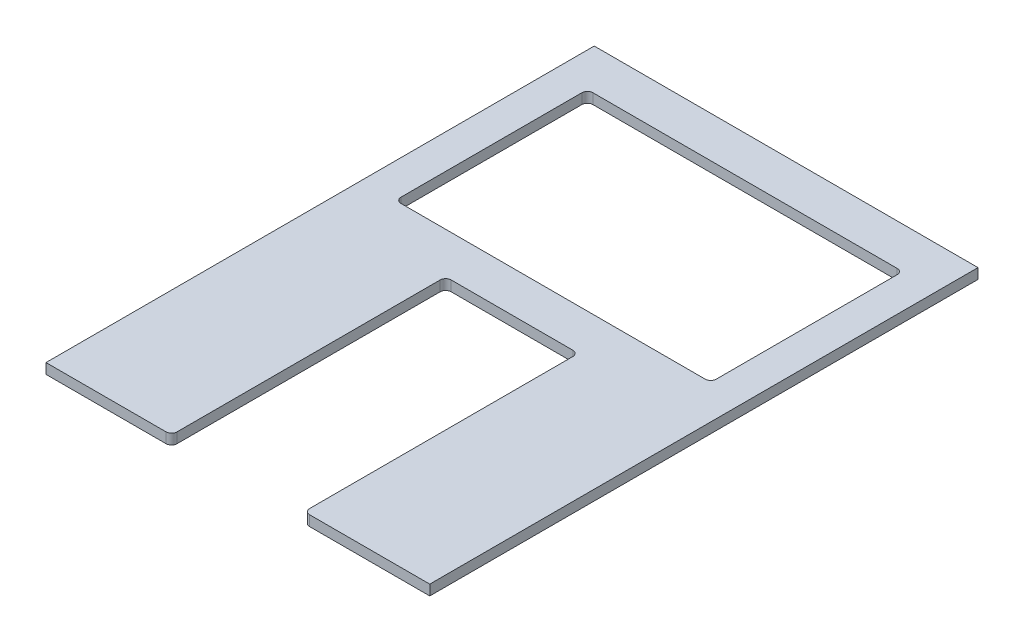
ISO-10303-21;
HEADER;
FILE_DESCRIPTION(('STEP AP214'),'2;1');
FILE_NAME('part.step','',(''),(''),'','','');
FILE_SCHEMA(('AUTOMOTIVE_DESIGN { 1 0 10303 214 1 1 1 1 }'));
ENDSEC;
DATA;
#1=APPLICATION_CONTEXT('core data for automotive mechanical design processes');
#2=APPLICATION_PROTOCOL_DEFINITION('international standard','automotive_design',2000,#1);
#3=PRODUCT_CONTEXT('',#1,'mechanical');
#4=PRODUCT('Part','Part','',(#3));
#5=PRODUCT_RELATED_PRODUCT_CATEGORY('part','',(#4));
#6=PRODUCT_DEFINITION_FORMATION('','',#4);
#7=PRODUCT_DEFINITION_CONTEXT('part definition',#1,'design');
#8=PRODUCT_DEFINITION('design','',#6,#7);
#9=PRODUCT_DEFINITION_SHAPE('','',#8);
#10=(LENGTH_UNIT() NAMED_UNIT(*) SI_UNIT(.MILLI.,.METRE.));
#11=(NAMED_UNIT(*) PLANE_ANGLE_UNIT() SI_UNIT($,.RADIAN.));
#12=(NAMED_UNIT(*) SI_UNIT($,.STERADIAN.) SOLID_ANGLE_UNIT());
#13=UNCERTAINTY_MEASURE_WITH_UNIT(LENGTH_MEASURE(1.E-05),#10,'distance_accuracy_value','');
#14=(GEOMETRIC_REPRESENTATION_CONTEXT(3) GLOBAL_UNCERTAINTY_ASSIGNED_CONTEXT((#13)) GLOBAL_UNIT_ASSIGNED_CONTEXT((#10,
#11,#12)) REPRESENTATION_CONTEXT('',''));
#15=CARTESIAN_POINT('',(0.,0.,0.));
#16=DIRECTION('',(0.,0.,1.));
#17=DIRECTION('',(1.,0.,0.));
#18=AXIS2_PLACEMENT_3D('',#15,#16,#17);
#19=CARTESIAN_POINT('',(-88.9,4.7625,127.));
#20=DIRECTION('',(0.,1.,0.));
#21=DIRECTION('',(0.,0.,1.));
#22=AXIS2_PLACEMENT_3D('',#19,#20,#21);
#23=PLANE('',#22);
#24=DIRECTION('',(0.,0.,1.));
#25=VECTOR('',#24,1.);
#26=CARTESIAN_POINT('',(30.734,4.7625,0.));
#27=LINE('',#26,#25);
#28=CARTESIAN_POINT('',(30.734,4.7625,2.53999999999994));
#29=VERTEX_POINT('',#28);
#30=CARTESIAN_POINT('',(30.734,4.7625,124.46));
#31=VERTEX_POINT('',#30);
#32=EDGE_CURVE('E186',#29,#31,#27,.T.);
#33=ORIENTED_EDGE('',*,*,#32,.T.);
#34=CARTESIAN_POINT('',(33.274,4.7625,124.46));
#35=DIRECTION('',(0.,1.,0.));
#36=DIRECTION('',(0.,0.,1.));
#37=AXIS2_PLACEMENT_3D('',#34,#35,#36);
#38=CIRCLE('',#37,2.54);
#39=CARTESIAN_POINT('',(33.274,4.7625,127.));
#40=VERTEX_POINT('',#39);
#41=EDGE_CURVE('E182',#31,#40,#38,.T.);
#42=ORIENTED_EDGE('',*,*,#41,.T.);
#43=DIRECTION('',(1.,0.,0.));
#44=VECTOR('',#43,1.);
#45=CARTESIAN_POINT('',(88.9,4.7625,127.));
#46=LINE('',#45,#44);
#47=CARTESIAN_POINT('',(88.9,4.7625,127.));
#48=VERTEX_POINT('',#47);
#49=EDGE_CURVE('E175',#40,#48,#46,.T.);
#50=ORIENTED_EDGE('',*,*,#49,.T.);
#51=DIRECTION('',(0.,0.,-1.));
#52=VECTOR('',#51,1.);
#53=CARTESIAN_POINT('',(88.9,4.7625,-127.));
#54=LINE('',#53,#52);
#55=CARTESIAN_POINT('',(88.9,4.7625,-127.));
#56=VERTEX_POINT('',#55);
#57=EDGE_CURVE('E179',#48,#56,#54,.T.);
#58=ORIENTED_EDGE('',*,*,#57,.T.);
#59=DIRECTION('',(-1.,0.,0.));
#60=VECTOR('',#59,1.);
#61=CARTESIAN_POINT('',(88.9,4.7625,-127.));
#62=LINE('',#61,#60);
#63=CARTESIAN_POINT('',(-88.9,4.7625,-127.));
#64=VERTEX_POINT('',#63);
#65=EDGE_CURVE('E201',#56,#64,#62,.T.);
#66=ORIENTED_EDGE('',*,*,#65,.T.);
#67=DIRECTION('',(0.,0.,1.));
#68=VECTOR('',#67,1.);
#69=CARTESIAN_POINT('',(-88.9,4.7625,-127.));
#70=LINE('',#69,#68);
#71=CARTESIAN_POINT('',(-88.9,4.7625,127.));
#72=VERTEX_POINT('',#71);
#73=EDGE_CURVE('E203',#64,#72,#70,.T.);
#74=ORIENTED_EDGE('',*,*,#73,.T.);
#75=DIRECTION('',(1.,0.,0.));
#76=VECTOR('',#75,1.);
#77=CARTESIAN_POINT('',(-30.734,4.7625,127.));
#78=LINE('',#77,#76);
#79=CARTESIAN_POINT('',(-33.274,4.7625,127.));
#80=VERTEX_POINT('',#79);
#81=EDGE_CURVE('E229',#72,#80,#78,.T.);
#82=ORIENTED_EDGE('',*,*,#81,.T.);
#83=CARTESIAN_POINT('',(-33.274,4.7625,124.46));
#84=DIRECTION('',(0.,1.,0.));
#85=DIRECTION('',(0.,0.,1.));
#86=AXIS2_PLACEMENT_3D('',#83,#84,#85);
#87=CIRCLE('',#86,2.54);
#88=CARTESIAN_POINT('',(-30.734,4.7625,124.46));
#89=VERTEX_POINT('',#88);
#90=EDGE_CURVE('E246',#80,#89,#87,.T.);
#91=ORIENTED_EDGE('',*,*,#90,.T.);
#92=DIRECTION('',(0.,0.,-1.));
#93=VECTOR('',#92,1.);
#94=CARTESIAN_POINT('',(-30.734,4.7625,127.));
#95=LINE('',#94,#93);
#96=CARTESIAN_POINT('',(-30.734,4.7625,2.53999999999994));
#97=VERTEX_POINT('',#96);
#98=EDGE_CURVE('E337',#89,#97,#95,.T.);
#99=ORIENTED_EDGE('',*,*,#98,.T.);
#100=CARTESIAN_POINT('',(-28.194,4.7625,2.53999999999994));
#101=DIRECTION('',(0.,1.,0.));
#102=DIRECTION('',(0.,0.,1.));
#103=AXIS2_PLACEMENT_3D('',#100,#101,#102);
#104=CIRCLE('',#103,2.54);
#105=CARTESIAN_POINT('',(-28.194,4.7625,0.));
#106=VERTEX_POINT('',#105);
#107=EDGE_CURVE('E282',#97,#106,#104,.F.);
#108=ORIENTED_EDGE('',*,*,#107,.T.);
#109=DIRECTION('',(1.,0.,0.));
#110=VECTOR('',#109,1.);
#111=CARTESIAN_POINT('',(-30.734,4.7625,0.));
#112=LINE('',#111,#110);
#113=CARTESIAN_POINT('',(28.194,4.7625,0.));
#114=VERTEX_POINT('',#113);
#115=EDGE_CURVE('E340',#106,#114,#112,.T.);
#116=ORIENTED_EDGE('',*,*,#115,.T.);
#117=CARTESIAN_POINT('',(28.194,4.7625,2.53999999999994));
#118=DIRECTION('',(0.,1.,0.));
#119=DIRECTION('',(0.,0.,1.));
#120=AXIS2_PLACEMENT_3D('',#117,#118,#119);
#121=CIRCLE('',#120,2.54);
#122=EDGE_CURVE('E286',#114,#29,#121,.F.);
#123=ORIENTED_EDGE('',*,*,#122,.T.);
#124=EDGE_LOOP('',(#33,#42,#50,#58,#66,#74,#82,#91,#99,#108,#116,#123));
#125=FACE_BOUND('',#124,.T.);
#126=DIRECTION('',(1.,0.,0.));
#127=VECTOR('',#126,1.);
#128=CARTESIAN_POINT('',(73.025,4.7625,-19.05));
#129=LINE('',#128,#127);
#130=CARTESIAN_POINT('',(-70.485,4.7625,-19.05));
#131=VERTEX_POINT('',#130);
#132=CARTESIAN_POINT('',(70.485,4.7625,-19.05));
#133=VERTEX_POINT('',#132);
#134=EDGE_CURVE('E325',#131,#133,#129,.T.);
#135=ORIENTED_EDGE('',*,*,#134,.F.);
#136=CARTESIAN_POINT('',(-70.485,4.7625,-21.59));
#137=DIRECTION('',(0.,1.,0.));
#138=DIRECTION('',(0.,0.,1.));
#139=AXIS2_PLACEMENT_3D('',#136,#137,#138);
#140=CIRCLE('',#139,2.54);
#141=CARTESIAN_POINT('',(-73.025,4.7625,-21.59));
#142=VERTEX_POINT('',#141);
#143=EDGE_CURVE('E290',#131,#142,#140,.F.);
#144=ORIENTED_EDGE('',*,*,#143,.T.);
#145=DIRECTION('',(0.,0.,1.));
#146=VECTOR('',#145,1.);
#147=CARTESIAN_POINT('',(-73.025,4.7625,-107.95));
#148=LINE('',#147,#146);
#149=CARTESIAN_POINT('',(-73.025,4.7625,-105.41));
#150=VERTEX_POINT('',#149);
#151=EDGE_CURVE('E319',#150,#142,#148,.T.);
#152=ORIENTED_EDGE('',*,*,#151,.F.);
#153=CARTESIAN_POINT('',(-70.485,4.7625,-105.41));
#154=DIRECTION('',(0.,1.,0.));
#155=DIRECTION('',(0.,0.,1.));
#156=AXIS2_PLACEMENT_3D('',#153,#154,#155);
#157=CIRCLE('',#156,2.54);
#158=CARTESIAN_POINT('',(-70.485,4.7625,-107.95));
#159=VERTEX_POINT('',#158);
#160=EDGE_CURVE('E11',#150,#159,#157,.F.);
#161=ORIENTED_EDGE('',*,*,#160,.T.);
#162=DIRECTION('',(-1.,0.,0.));
#163=VECTOR('',#162,1.);
#164=CARTESIAN_POINT('',(73.025,4.7625,-107.95));
#165=LINE('',#164,#163);
#166=CARTESIAN_POINT('',(70.485,4.7625,-107.95));
#167=VERTEX_POINT('',#166);
#168=EDGE_CURVE('E213',#167,#159,#165,.T.);
#169=ORIENTED_EDGE('',*,*,#168,.F.);
#170=CARTESIAN_POINT('',(70.485,4.7625,-105.41));
#171=DIRECTION('',(0.,1.,0.));
#172=DIRECTION('',(0.,0.,1.));
#173=AXIS2_PLACEMENT_3D('',#170,#171,#172);
#174=CIRCLE('',#173,2.54);
#175=CARTESIAN_POINT('',(73.025,4.7625,-105.41));
#176=VERTEX_POINT('',#175);
#177=EDGE_CURVE('E53',#167,#176,#174,.F.);
#178=ORIENTED_EDGE('',*,*,#177,.T.);
#179=DIRECTION('',(0.,0.,-1.));
#180=VECTOR('',#179,1.);
#181=CARTESIAN_POINT('',(73.025,4.7625,-107.95));
#182=LINE('',#181,#180);
#183=CARTESIAN_POINT('',(73.025,4.7625,-21.59));
#184=VERTEX_POINT('',#183);
#185=EDGE_CURVE('E323',#184,#176,#182,.T.);
#186=ORIENTED_EDGE('',*,*,#185,.F.);
#187=CARTESIAN_POINT('',(70.485,4.7625,-21.59));
#188=DIRECTION('',(0.,1.,0.));
#189=DIRECTION('',(0.,0.,1.));
#190=AXIS2_PLACEMENT_3D('',#187,#188,#189);
#191=CIRCLE('',#190,2.54);
#192=EDGE_CURVE('E294',#184,#133,#191,.F.);
#193=ORIENTED_EDGE('',*,*,#192,.T.);
#194=EDGE_LOOP('',(#135,#144,#152,#161,#169,#178,#186,#193));
#195=FACE_BOUND('',#194,.T.);
#196=ADVANCED_FACE('F38',(#125,#195),#23,.T.);
#197=CARTESIAN_POINT('',(-88.9,0.,127.));
#198=DIRECTION('',(0.,1.,0.));
#199=DIRECTION('',(0.,0.,1.));
#200=AXIS2_PLACEMENT_3D('',#197,#198,#199);
#201=PLANE('',#200);
#202=DIRECTION('',(1.,0.,0.));
#203=VECTOR('',#202,1.);
#204=CARTESIAN_POINT('',(88.9,0.,127.));
#205=LINE('',#204,#203);
#206=CARTESIAN_POINT('',(33.274,0.,127.));
#207=VERTEX_POINT('',#206);
#208=CARTESIAN_POINT('',(88.9,0.,127.));
#209=VERTEX_POINT('',#208);
#210=EDGE_CURVE('E192',#207,#209,#205,.T.);
#211=ORIENTED_EDGE('',*,*,#210,.F.);
#212=CARTESIAN_POINT('',(33.274,0.,124.46));
#213=DIRECTION('',(0.,1.,0.));
#214=DIRECTION('',(0.,0.,1.));
#215=AXIS2_PLACEMENT_3D('',#212,#213,#214);
#216=CIRCLE('',#215,2.54);
#217=CARTESIAN_POINT('',(30.734,0.,124.46));
#218=VERTEX_POINT('',#217);
#219=EDGE_CURVE('E239',#207,#218,#216,.F.);
#220=ORIENTED_EDGE('',*,*,#219,.T.);
#221=DIRECTION('',(0.,0.,1.));
#222=VECTOR('',#221,1.);
#223=CARTESIAN_POINT('',(30.734,0.,0.));
#224=LINE('',#223,#222);
#225=CARTESIAN_POINT('',(30.734,0.,2.53999999999994));
#226=VERTEX_POINT('',#225);
#227=EDGE_CURVE('E219',#226,#218,#224,.T.);
#228=ORIENTED_EDGE('',*,*,#227,.F.);
#229=CARTESIAN_POINT('',(28.194,0.,2.53999999999994));
#230=DIRECTION('',(0.,1.,0.));
#231=DIRECTION('',(0.,0.,1.));
#232=AXIS2_PLACEMENT_3D('',#229,#230,#231);
#233=CIRCLE('',#232,2.54);
#234=CARTESIAN_POINT('',(28.194,0.,0.));
#235=VERTEX_POINT('',#234);
#236=EDGE_CURVE('E284',#226,#235,#233,.T.);
#237=ORIENTED_EDGE('',*,*,#236,.T.);
#238=DIRECTION('',(1.,0.,0.));
#239=VECTOR('',#238,1.);
#240=CARTESIAN_POINT('',(-30.734,0.,0.));
#241=LINE('',#240,#239);
#242=CARTESIAN_POINT('',(-28.194,0.,0.));
#243=VERTEX_POINT('',#242);
#244=EDGE_CURVE('E216',#243,#235,#241,.T.);
#245=ORIENTED_EDGE('',*,*,#244,.F.);
#246=CARTESIAN_POINT('',(-28.194,0.,2.53999999999994));
#247=DIRECTION('',(0.,1.,0.));
#248=DIRECTION('',(0.,0.,1.));
#249=AXIS2_PLACEMENT_3D('',#246,#247,#248);
#250=CIRCLE('',#249,2.54);
#251=CARTESIAN_POINT('',(-30.734,0.,2.53999999999994));
#252=VERTEX_POINT('',#251);
#253=EDGE_CURVE('E280',#243,#252,#250,.T.);
#254=ORIENTED_EDGE('',*,*,#253,.T.);
#255=DIRECTION('',(0.,0.,-1.));
#256=VECTOR('',#255,1.);
#257=CARTESIAN_POINT('',(-30.734,0.,127.));
#258=LINE('',#257,#256);
#259=CARTESIAN_POINT('',(-30.734,0.,124.46));
#260=VERTEX_POINT('',#259);
#261=EDGE_CURVE('E212',#260,#252,#258,.T.);
#262=ORIENTED_EDGE('',*,*,#261,.F.);
#263=CARTESIAN_POINT('',(-33.274,0.,124.46));
#264=DIRECTION('',(0.,1.,0.));
#265=DIRECTION('',(0.,0.,1.));
#266=AXIS2_PLACEMENT_3D('',#263,#264,#265);
#267=CIRCLE('',#266,2.54);
#268=CARTESIAN_POINT('',(-33.274,0.,127.));
#269=VERTEX_POINT('',#268);
#270=EDGE_CURVE('E237',#260,#269,#267,.F.);
#271=ORIENTED_EDGE('',*,*,#270,.T.);
#272=DIRECTION('',(1.,0.,0.));
#273=VECTOR('',#272,1.);
#274=CARTESIAN_POINT('',(-30.734,0.,127.));
#275=LINE('',#274,#273);
#276=CARTESIAN_POINT('',(-88.9,0.,127.));
#277=VERTEX_POINT('',#276);
#278=EDGE_CURVE('E209',#277,#269,#275,.T.);
#279=ORIENTED_EDGE('',*,*,#278,.F.);
#280=DIRECTION('',(0.,0.,1.));
#281=VECTOR('',#280,1.);
#282=CARTESIAN_POINT('',(-88.9,0.,-127.));
#283=LINE('',#282,#281);
#284=CARTESIAN_POINT('',(-88.9,0.,-127.));
#285=VERTEX_POINT('',#284);
#286=EDGE_CURVE('E227',#285,#277,#283,.T.);
#287=ORIENTED_EDGE('',*,*,#286,.F.);
#288=DIRECTION('',(-1.,0.,0.));
#289=VECTOR('',#288,1.);
#290=CARTESIAN_POINT('',(88.9,0.,-127.));
#291=LINE('',#290,#289);
#292=CARTESIAN_POINT('',(88.9,0.,-127.));
#293=VERTEX_POINT('',#292);
#294=EDGE_CURVE('E225',#293,#285,#291,.T.);
#295=ORIENTED_EDGE('',*,*,#294,.F.);
#296=DIRECTION('',(0.,0.,-1.));
#297=VECTOR('',#296,1.);
#298=CARTESIAN_POINT('',(88.9,0.,-127.));
#299=LINE('',#298,#297);
#300=EDGE_CURVE('E223',#209,#293,#299,.T.);
#301=ORIENTED_EDGE('',*,*,#300,.F.);
#302=EDGE_LOOP('',(#211,#220,#228,#237,#245,#254,#262,#271,#279,#287,#295,#301));
#303=FACE_BOUND('',#302,.T.);
#304=DIRECTION('',(-1.,0.,0.));
#305=VECTOR('',#304,1.);
#306=CARTESIAN_POINT('',(73.025,0.,-107.95));
#307=LINE('',#306,#305);
#308=CARTESIAN_POINT('',(70.485,0.,-107.95));
#309=VERTEX_POINT('',#308);
#310=CARTESIAN_POINT('',(-70.485,0.,-107.95));
#311=VERTEX_POINT('',#310);
#312=EDGE_CURVE('E305',#309,#311,#307,.T.);
#313=ORIENTED_EDGE('',*,*,#312,.T.);
#314=CARTESIAN_POINT('',(-70.485,0.,-105.41));
#315=DIRECTION('',(0.,1.,0.));
#316=DIRECTION('',(0.,0.,1.));
#317=AXIS2_PLACEMENT_3D('',#314,#315,#316);
#318=CIRCLE('',#317,2.54);
#319=CARTESIAN_POINT('',(-73.025,0.,-105.41));
#320=VERTEX_POINT('',#319);
#321=EDGE_CURVE('E46',#311,#320,#318,.T.);
#322=ORIENTED_EDGE('',*,*,#321,.T.);
#323=DIRECTION('',(0.,0.,1.));
#324=VECTOR('',#323,1.);
#325=CARTESIAN_POINT('',(-73.025,0.,-107.95));
#326=LINE('',#325,#324);
#327=CARTESIAN_POINT('',(-73.025,0.,-21.59));
#328=VERTEX_POINT('',#327);
#329=EDGE_CURVE('E303',#320,#328,#326,.T.);
#330=ORIENTED_EDGE('',*,*,#329,.T.);
#331=CARTESIAN_POINT('',(-70.485,0.,-21.59));
#332=DIRECTION('',(0.,1.,0.));
#333=DIRECTION('',(0.,0.,1.));
#334=AXIS2_PLACEMENT_3D('',#331,#332,#333);
#335=CIRCLE('',#334,2.54);
#336=CARTESIAN_POINT('',(-70.485,0.,-19.05));
#337=VERTEX_POINT('',#336);
#338=EDGE_CURVE('E288',#328,#337,#335,.T.);
#339=ORIENTED_EDGE('',*,*,#338,.T.);
#340=DIRECTION('',(1.,0.,0.));
#341=VECTOR('',#340,1.);
#342=CARTESIAN_POINT('',(73.025,0.,-19.05));
#343=LINE('',#342,#341);
#344=CARTESIAN_POINT('',(70.485,0.,-19.05));
#345=VERTEX_POINT('',#344);
#346=EDGE_CURVE('E314',#337,#345,#343,.T.);
#347=ORIENTED_EDGE('',*,*,#346,.T.);
#348=CARTESIAN_POINT('',(70.485,0.,-21.59));
#349=DIRECTION('',(0.,1.,0.));
#350=DIRECTION('',(0.,0.,1.));
#351=AXIS2_PLACEMENT_3D('',#348,#349,#350);
#352=CIRCLE('',#351,2.54);
#353=CARTESIAN_POINT('',(73.025,0.,-21.59));
#354=VERTEX_POINT('',#353);
#355=EDGE_CURVE('E292',#345,#354,#352,.T.);
#356=ORIENTED_EDGE('',*,*,#355,.T.);
#357=DIRECTION('',(0.,0.,-1.));
#358=VECTOR('',#357,1.);
#359=CARTESIAN_POINT('',(73.025,0.,-107.95));
#360=LINE('',#359,#358);
#361=CARTESIAN_POINT('',(73.025,0.,-105.41));
#362=VERTEX_POINT('',#361);
#363=EDGE_CURVE('E331',#354,#362,#360,.T.);
#364=ORIENTED_EDGE('',*,*,#363,.T.);
#365=CARTESIAN_POINT('',(70.485,0.,-105.41));
#366=DIRECTION('',(0.,1.,0.));
#367=DIRECTION('',(0.,0.,1.));
#368=AXIS2_PLACEMENT_3D('',#365,#366,#367);
#369=CIRCLE('',#368,2.54);
#370=EDGE_CURVE('E296',#362,#309,#369,.T.);
#371=ORIENTED_EDGE('',*,*,#370,.T.);
#372=EDGE_LOOP('',(#313,#322,#330,#339,#347,#356,#364,#371));
#373=FACE_BOUND('',#372,.T.);
#374=ADVANCED_FACE('F302',(#303,#373),#201,.F.);
#375=CARTESIAN_POINT('',(-30.734,4.7625,127.));
#376=DIRECTION('',(0.,0.,-1.));
#377=DIRECTION('',(-1.,0.,0.));
#378=AXIS2_PLACEMENT_3D('',#375,#376,#377);
#379=PLANE('',#378);
#380=ORIENTED_EDGE('',*,*,#278,.T.);
#381=DIRECTION('',(0.,-1.,0.));
#382=VECTOR('',#381,1.);
#383=CARTESIAN_POINT('',(-33.274,4.7625,127.));
#384=LINE('',#383,#382);
#385=EDGE_CURVE('E254',#269,#80,#384,.F.);
#386=ORIENTED_EDGE('',*,*,#385,.T.);
#387=ORIENTED_EDGE('',*,*,#81,.F.);
#388=DIRECTION('',(0.,-1.,0.));
#389=VECTOR('',#388,1.);
#390=CARTESIAN_POINT('',(-88.9,4.7625,127.));
#391=LINE('',#390,#389);
#392=EDGE_CURVE('E208',#72,#277,#391,.T.);
#393=ORIENTED_EDGE('',*,*,#392,.T.);
#394=EDGE_LOOP('',(#380,#386,#387,#393));
#395=FACE_BOUND('',#394,.T.);
#396=ADVANCED_FACE('F364',(#395),#379,.F.);
#397=CARTESIAN_POINT('',(-30.734,4.7625,127.));
#398=DIRECTION('',(-1.,0.,0.));
#399=DIRECTION('',(0.,0.,1.));
#400=AXIS2_PLACEMENT_3D('',#397,#398,#399);
#401=PLANE('',#400);
#402=ORIENTED_EDGE('',*,*,#98,.F.);
#403=DIRECTION('',(0.,-1.,0.));
#404=VECTOR('',#403,1.);
#405=CARTESIAN_POINT('',(-30.734,4.7625,124.46));
#406=LINE('',#405,#404);
#407=EDGE_CURVE('E251',#89,#260,#406,.T.);
#408=ORIENTED_EDGE('',*,*,#407,.T.);
#409=ORIENTED_EDGE('',*,*,#261,.T.);
#410=DIRECTION('',(0.,-1.,0.));
#411=VECTOR('',#410,1.);
#412=CARTESIAN_POINT('',(-30.734,4.7625,2.53999999999994));
#413=LINE('',#412,#411);
#414=EDGE_CURVE('E249',#252,#97,#413,.F.);
#415=ORIENTED_EDGE('',*,*,#414,.T.);
#416=EDGE_LOOP('',(#402,#408,#409,#415));
#417=FACE_BOUND('',#416,.T.);
#418=ADVANCED_FACE('F372',(#417),#401,.F.);
#419=CARTESIAN_POINT('',(-30.734,4.7625,0.));
#420=DIRECTION('',(0.,0.,-1.));
#421=DIRECTION('',(-1.,0.,0.));
#422=AXIS2_PLACEMENT_3D('',#419,#420,#421);
#423=PLANE('',#422);
#424=ORIENTED_EDGE('',*,*,#115,.F.);
#425=DIRECTION('',(0.,-1.,0.));
#426=VECTOR('',#425,1.);
#427=CARTESIAN_POINT('',(-28.194,0.,0.));
#428=LINE('',#427,#426);
#429=EDGE_CURVE('E258',#106,#243,#428,.T.);
#430=ORIENTED_EDGE('',*,*,#429,.T.);
#431=ORIENTED_EDGE('',*,*,#244,.T.);
#432=DIRECTION('',(0.,-1.,0.));
#433=VECTOR('',#432,1.);
#434=CARTESIAN_POINT('',(28.194,4.7625,0.));
#435=LINE('',#434,#433);
#436=EDGE_CURVE('E256',#235,#114,#435,.F.);
#437=ORIENTED_EDGE('',*,*,#436,.T.);
#438=EDGE_LOOP('',(#424,#430,#431,#437));
#439=FACE_BOUND('',#438,.T.);
#440=ADVANCED_FACE('F380',(#439),#423,.F.);
#441=CARTESIAN_POINT('',(30.734,4.7625,0.));
#442=DIRECTION('',(1.,0.,0.));
#443=DIRECTION('',(0.,0.,-1.));
#444=AXIS2_PLACEMENT_3D('',#441,#442,#443);
#445=PLANE('',#444);
#446=ORIENTED_EDGE('',*,*,#227,.T.);
#447=DIRECTION('',(0.,-1.,0.));
#448=VECTOR('',#447,1.);
#449=CARTESIAN_POINT('',(30.734,4.7625,124.46));
#450=LINE('',#449,#448);
#451=EDGE_CURVE('E244',#218,#31,#450,.F.);
#452=ORIENTED_EDGE('',*,*,#451,.T.);
#453=ORIENTED_EDGE('',*,*,#32,.F.);
#454=DIRECTION('',(0.,-1.,0.));
#455=VECTOR('',#454,1.);
#456=CARTESIAN_POINT('',(30.734,0.,2.53999999999994));
#457=LINE('',#456,#455);
#458=EDGE_CURVE('E241',#29,#226,#457,.T.);
#459=ORIENTED_EDGE('',*,*,#458,.T.);
#460=EDGE_LOOP('',(#446,#452,#453,#459));
#461=FACE_BOUND('',#460,.T.);
#462=ADVANCED_FACE('F385',(#461),#445,.F.);
#463=CARTESIAN_POINT('',(88.9,4.7625,127.));
#464=DIRECTION('',(0.,0.,-1.));
#465=DIRECTION('',(-1.,0.,0.));
#466=AXIS2_PLACEMENT_3D('',#463,#464,#465);
#467=PLANE('',#466);
#468=ORIENTED_EDGE('',*,*,#49,.F.);
#469=DIRECTION('',(0.,-1.,0.));
#470=VECTOR('',#469,1.);
#471=CARTESIAN_POINT('',(33.274,4.7625,127.));
#472=LINE('',#471,#470);
#473=EDGE_CURVE('E195',#40,#207,#472,.T.);
#474=ORIENTED_EDGE('',*,*,#473,.T.);
#475=ORIENTED_EDGE('',*,*,#210,.T.);
#476=DIRECTION('',(0.,-1.,0.));
#477=VECTOR('',#476,1.);
#478=CARTESIAN_POINT('',(88.9,4.7625,127.));
#479=LINE('',#478,#477);
#480=EDGE_CURVE('E189',#48,#209,#479,.T.);
#481=ORIENTED_EDGE('',*,*,#480,.F.);
#482=EDGE_LOOP('',(#468,#474,#475,#481));
#483=FACE_BOUND('',#482,.T.);
#484=ADVANCED_FACE('F190',(#483),#467,.F.);
#485=CARTESIAN_POINT('',(88.9,4.7625,-127.));
#486=DIRECTION('',(-1.,0.,0.));
#487=DIRECTION('',(0.,0.,1.));
#488=AXIS2_PLACEMENT_3D('',#485,#486,#487);
#489=PLANE('',#488);
#490=ORIENTED_EDGE('',*,*,#300,.T.);
#491=DIRECTION('',(0.,-1.,0.));
#492=VECTOR('',#491,1.);
#493=CARTESIAN_POINT('',(88.9,4.7625,-127.));
#494=LINE('',#493,#492);
#495=EDGE_CURVE('E196',#56,#293,#494,.T.);
#496=ORIENTED_EDGE('',*,*,#495,.F.);
#497=ORIENTED_EDGE('',*,*,#57,.F.);
#498=ORIENTED_EDGE('',*,*,#480,.T.);
#499=EDGE_LOOP('',(#490,#496,#497,#498));
#500=FACE_BOUND('',#499,.T.);
#501=ADVANCED_FACE('F198',(#500),#489,.F.);
#502=CARTESIAN_POINT('',(88.9,4.7625,-127.));
#503=DIRECTION('',(0.,0.,1.));
#504=DIRECTION('',(1.,0.,0.));
#505=AXIS2_PLACEMENT_3D('',#502,#503,#504);
#506=PLANE('',#505);
#507=ORIENTED_EDGE('',*,*,#294,.T.);
#508=DIRECTION('',(0.,-1.,0.));
#509=VECTOR('',#508,1.);
#510=CARTESIAN_POINT('',(-88.9,4.7625,-127.));
#511=LINE('',#510,#509);
#512=EDGE_CURVE('E232',#64,#285,#511,.T.);
#513=ORIENTED_EDGE('',*,*,#512,.F.);
#514=ORIENTED_EDGE('',*,*,#65,.F.);
#515=ORIENTED_EDGE('',*,*,#495,.T.);
#516=EDGE_LOOP('',(#507,#513,#514,#515));
#517=FACE_BOUND('',#516,.T.);
#518=ADVANCED_FACE('F354',(#517),#506,.F.);
#519=CARTESIAN_POINT('',(-88.9,4.7625,-127.));
#520=DIRECTION('',(1.,0.,0.));
#521=DIRECTION('',(0.,0.,-1.));
#522=AXIS2_PLACEMENT_3D('',#519,#520,#521);
#523=PLANE('',#522);
#524=ORIENTED_EDGE('',*,*,#286,.T.);
#525=ORIENTED_EDGE('',*,*,#392,.F.);
#526=ORIENTED_EDGE('',*,*,#73,.F.);
#527=ORIENTED_EDGE('',*,*,#512,.T.);
#528=EDGE_LOOP('',(#524,#525,#526,#527));
#529=FACE_BOUND('',#528,.T.);
#530=ADVANCED_FACE('F361',(#529),#523,.F.);
#531=CARTESIAN_POINT('',(-73.025,4.7625,-107.95));
#532=DIRECTION('',(1.,0.,0.));
#533=DIRECTION('',(0.,0.,-1.));
#534=AXIS2_PLACEMENT_3D('',#531,#532,#533);
#535=PLANE('',#534);
#536=ORIENTED_EDGE('',*,*,#151,.T.);
#537=DIRECTION('',(0.,-1.,0.));
#538=VECTOR('',#537,1.);
#539=CARTESIAN_POINT('',(-73.025,0.,-21.59));
#540=LINE('',#539,#538);
#541=EDGE_CURVE('E263',#142,#328,#540,.T.);
#542=ORIENTED_EDGE('',*,*,#541,.T.);
#543=ORIENTED_EDGE('',*,*,#329,.F.);
#544=DIRECTION('',(0.,-1.,0.));
#545=VECTOR('',#544,1.);
#546=CARTESIAN_POINT('',(-73.025,4.7625,-105.41));
#547=LINE('',#546,#545);
#548=EDGE_CURVE('E261',#320,#150,#547,.F.);
#549=ORIENTED_EDGE('',*,*,#548,.T.);
#550=EDGE_LOOP('',(#536,#542,#543,#549));
#551=FACE_BOUND('',#550,.T.);
#552=ADVANCED_FACE('F311',(#551),#535,.T.);
#553=CARTESIAN_POINT('',(73.025,4.7625,-19.05));
#554=DIRECTION('',(0.,0.,-1.));
#555=DIRECTION('',(-1.,0.,0.));
#556=AXIS2_PLACEMENT_3D('',#553,#554,#555);
#557=PLANE('',#556);
#558=ORIENTED_EDGE('',*,*,#346,.F.);
#559=DIRECTION('',(0.,-1.,0.));
#560=VECTOR('',#559,1.);
#561=CARTESIAN_POINT('',(-70.485,4.7625,-19.05));
#562=LINE('',#561,#560);
#563=EDGE_CURVE('E269',#337,#131,#562,.F.);
#564=ORIENTED_EDGE('',*,*,#563,.T.);
#565=ORIENTED_EDGE('',*,*,#134,.T.);
#566=DIRECTION('',(0.,-1.,0.));
#567=VECTOR('',#566,1.);
#568=CARTESIAN_POINT('',(70.485,0.,-19.05));
#569=LINE('',#568,#567);
#570=EDGE_CURVE('E266',#133,#345,#569,.T.);
#571=ORIENTED_EDGE('',*,*,#570,.T.);
#572=EDGE_LOOP('',(#558,#564,#565,#571));
#573=FACE_BOUND('',#572,.T.);
#574=ADVANCED_FACE('F427',(#573),#557,.T.);
#575=CARTESIAN_POINT('',(73.025,4.7625,-107.95));
#576=DIRECTION('',(-1.,0.,0.));
#577=DIRECTION('',(0.,0.,1.));
#578=AXIS2_PLACEMENT_3D('',#575,#576,#577);
#579=PLANE('',#578);
#580=ORIENTED_EDGE('',*,*,#363,.F.);
#581=DIRECTION('',(0.,-1.,0.));
#582=VECTOR('',#581,1.);
#583=CARTESIAN_POINT('',(73.025,4.7625,-21.59));
#584=LINE('',#583,#582);
#585=EDGE_CURVE('E60',#354,#184,#584,.F.);
#586=ORIENTED_EDGE('',*,*,#585,.T.);
#587=ORIENTED_EDGE('',*,*,#185,.T.);
#588=DIRECTION('',(0.,-1.,0.));
#589=VECTOR('',#588,1.);
#590=CARTESIAN_POINT('',(73.025,0.,-105.41));
#591=LINE('',#590,#589);
#592=EDGE_CURVE('E271',#176,#362,#591,.T.);
#593=ORIENTED_EDGE('',*,*,#592,.T.);
#594=EDGE_LOOP('',(#580,#586,#587,#593));
#595=FACE_BOUND('',#594,.T.);
#596=ADVANCED_FACE('F433',(#595),#579,.T.);
#597=CARTESIAN_POINT('',(73.025,4.7625,-107.95));
#598=DIRECTION('',(0.,0.,1.));
#599=DIRECTION('',(1.,0.,0.));
#600=AXIS2_PLACEMENT_3D('',#597,#598,#599);
#601=PLANE('',#600);
#602=ORIENTED_EDGE('',*,*,#312,.F.);
#603=DIRECTION('',(0.,-1.,0.));
#604=VECTOR('',#603,1.);
#605=CARTESIAN_POINT('',(70.485,4.7625,-107.95));
#606=LINE('',#605,#604);
#607=EDGE_CURVE('E278',#309,#167,#606,.F.);
#608=ORIENTED_EDGE('',*,*,#607,.T.);
#609=ORIENTED_EDGE('',*,*,#168,.T.);
#610=DIRECTION('',(0.,-1.,0.));
#611=VECTOR('',#610,1.);
#612=CARTESIAN_POINT('',(-70.485,0.,-107.95));
#613=LINE('',#612,#611);
#614=EDGE_CURVE('E275',#159,#311,#613,.T.);
#615=ORIENTED_EDGE('',*,*,#614,.T.);
#616=EDGE_LOOP('',(#602,#608,#609,#615));
#617=FACE_BOUND('',#616,.T.);
#618=ADVANCED_FACE('F321',(#617),#601,.T.);
#619=CARTESIAN_POINT('',(33.274,4.7625,124.46));
#620=DIRECTION('',(0.,-1.,0.));
#621=DIRECTION('',(0.,0.,-1.));
#622=AXIS2_PLACEMENT_3D('',#619,#620,#621);
#623=CYLINDRICAL_SURFACE('',#622,2.54);
#624=ORIENTED_EDGE('',*,*,#41,.F.);
#625=ORIENTED_EDGE('',*,*,#451,.F.);
#626=ORIENTED_EDGE('',*,*,#219,.F.);
#627=ORIENTED_EDGE('',*,*,#473,.F.);
#628=EDGE_LOOP('',(#624,#625,#626,#627));
#629=FACE_BOUND('',#628,.T.);
#630=ADVANCED_FACE('F348',(#629),#623,.T.);
#631=CARTESIAN_POINT('',(-33.274,4.7625,124.46));
#632=DIRECTION('',(0.,-1.,0.));
#633=DIRECTION('',(0.,0.,-1.));
#634=AXIS2_PLACEMENT_3D('',#631,#632,#633);
#635=CYLINDRICAL_SURFACE('',#634,2.54);
#636=ORIENTED_EDGE('',*,*,#90,.F.);
#637=ORIENTED_EDGE('',*,*,#385,.F.);
#638=ORIENTED_EDGE('',*,*,#270,.F.);
#639=ORIENTED_EDGE('',*,*,#407,.F.);
#640=EDGE_LOOP('',(#636,#637,#638,#639));
#641=FACE_BOUND('',#640,.T.);
#642=ADVANCED_FACE('F367',(#641),#635,.T.);
#643=CARTESIAN_POINT('',(-28.194,4.7625,2.53999999999994));
#644=DIRECTION('',(0.,1.,0.));
#645=DIRECTION('',(0.,0.,1.));
#646=AXIS2_PLACEMENT_3D('',#643,#644,#645);
#647=CYLINDRICAL_SURFACE('',#646,2.54);
#648=ORIENTED_EDGE('',*,*,#107,.F.);
#649=ORIENTED_EDGE('',*,*,#414,.F.);
#650=ORIENTED_EDGE('',*,*,#253,.F.);
#651=ORIENTED_EDGE('',*,*,#429,.F.);
#652=EDGE_LOOP('',(#648,#649,#650,#651));
#653=FACE_BOUND('',#652,.T.);
#654=ADVANCED_FACE('F376',(#653),#647,.F.);
#655=CARTESIAN_POINT('',(28.194,4.7625,2.53999999999994));
#656=DIRECTION('',(0.,1.,0.));
#657=DIRECTION('',(0.,0.,1.));
#658=AXIS2_PLACEMENT_3D('',#655,#656,#657);
#659=CYLINDRICAL_SURFACE('',#658,2.54);
#660=ORIENTED_EDGE('',*,*,#122,.F.);
#661=ORIENTED_EDGE('',*,*,#436,.F.);
#662=ORIENTED_EDGE('',*,*,#236,.F.);
#663=ORIENTED_EDGE('',*,*,#458,.F.);
#664=EDGE_LOOP('',(#660,#661,#662,#663));
#665=FACE_BOUND('',#664,.T.);
#666=ADVANCED_FACE('F384',(#665),#659,.F.);
#667=CARTESIAN_POINT('',(-70.485,4.7625,-21.59));
#668=DIRECTION('',(0.,1.,0.));
#669=DIRECTION('',(0.,0.,1.));
#670=AXIS2_PLACEMENT_3D('',#667,#668,#669);
#671=CYLINDRICAL_SURFACE('',#670,2.54);
#672=ORIENTED_EDGE('',*,*,#143,.F.);
#673=ORIENTED_EDGE('',*,*,#563,.F.);
#674=ORIENTED_EDGE('',*,*,#338,.F.);
#675=ORIENTED_EDGE('',*,*,#541,.F.);
#676=EDGE_LOOP('',(#672,#673,#674,#675));
#677=FACE_BOUND('',#676,.T.);
#678=ADVANCED_FACE('F470',(#677),#671,.F.);
#679=CARTESIAN_POINT('',(70.485,4.7625,-21.59));
#680=DIRECTION('',(0.,1.,0.));
#681=DIRECTION('',(0.,0.,1.));
#682=AXIS2_PLACEMENT_3D('',#679,#680,#681);
#683=CYLINDRICAL_SURFACE('',#682,2.54);
#684=ORIENTED_EDGE('',*,*,#192,.F.);
#685=ORIENTED_EDGE('',*,*,#585,.F.);
#686=ORIENTED_EDGE('',*,*,#355,.F.);
#687=ORIENTED_EDGE('',*,*,#570,.F.);
#688=EDGE_LOOP('',(#684,#685,#686,#687));
#689=FACE_BOUND('',#688,.T.);
#690=ADVANCED_FACE('F477',(#689),#683,.F.);
#691=CARTESIAN_POINT('',(70.485,4.7625,-105.41));
#692=DIRECTION('',(0.,1.,0.));
#693=DIRECTION('',(0.,0.,1.));
#694=AXIS2_PLACEMENT_3D('',#691,#692,#693);
#695=CYLINDRICAL_SURFACE('',#694,2.54);
#696=ORIENTED_EDGE('',*,*,#177,.F.);
#697=ORIENTED_EDGE('',*,*,#607,.F.);
#698=ORIENTED_EDGE('',*,*,#370,.F.);
#699=ORIENTED_EDGE('',*,*,#592,.F.);
#700=EDGE_LOOP('',(#696,#697,#698,#699));
#701=FACE_BOUND('',#700,.T.);
#702=ADVANCED_FACE('F485',(#701),#695,.F.);
#703=CARTESIAN_POINT('',(-70.485,4.7625,-105.41));
#704=DIRECTION('',(0.,1.,0.));
#705=DIRECTION('',(0.,0.,1.));
#706=AXIS2_PLACEMENT_3D('',#703,#704,#705);
#707=CYLINDRICAL_SURFACE('',#706,2.54);
#708=ORIENTED_EDGE('',*,*,#160,.F.);
#709=ORIENTED_EDGE('',*,*,#548,.F.);
#710=ORIENTED_EDGE('',*,*,#321,.F.);
#711=ORIENTED_EDGE('',*,*,#614,.F.);
#712=EDGE_LOOP('',(#708,#709,#710,#711));
#713=FACE_BOUND('',#712,.T.);
#714=ADVANCED_FACE('F40',(#713),#707,.F.);
#715=CLOSED_SHELL('',(#196,#374,#396,#418,#440,#462,#484,#501,#518,#530,#552,#574,#596,#618,
#630,#642,#654,#666,#678,#690,#702,#714));
#716=MANIFOLD_SOLID_BREP('B2',#715);
#717=ADVANCED_BREP_SHAPE_REPRESENTATION('',(#18,#716),#14);
#718=SHAPE_DEFINITION_REPRESENTATION(#9,#717);
ENDSEC;
END-ISO-10303-21;
